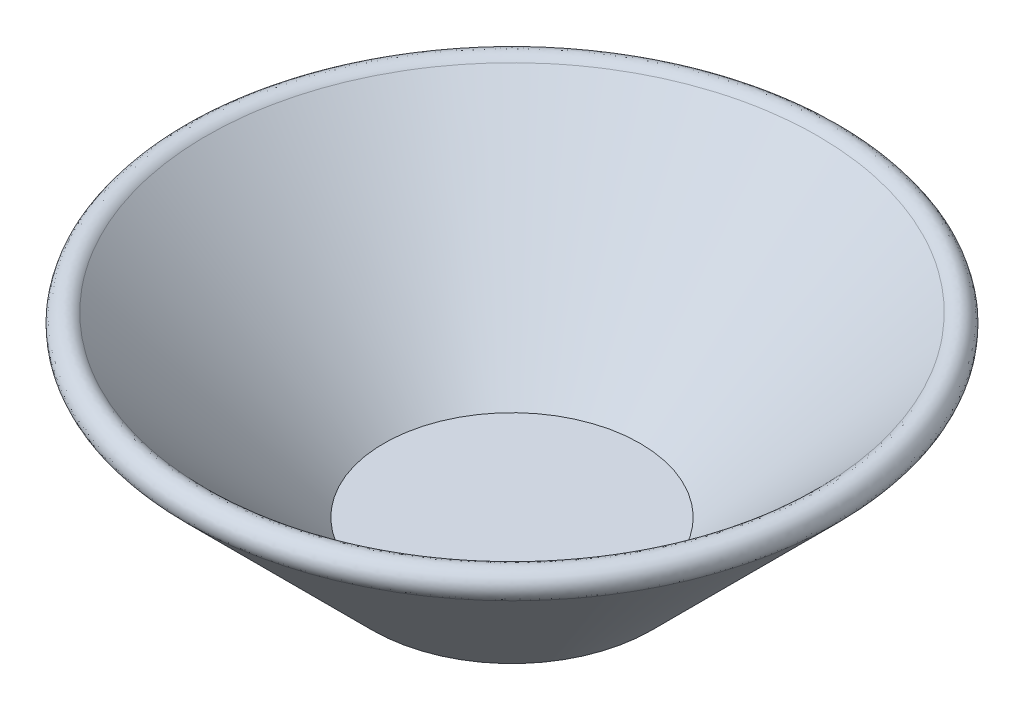
ISO-10303-21;
HEADER;
FILE_DESCRIPTION(('STEP AP214'),'2;1');
FILE_NAME('part.step','',(''),(''),'','','');
FILE_SCHEMA(('AUTOMOTIVE_DESIGN { 1 0 10303 214 1 1 1 1 }'));
ENDSEC;
DATA;
#1=APPLICATION_CONTEXT('core data for automotive mechanical design processes');
#2=APPLICATION_PROTOCOL_DEFINITION('international standard','automotive_design',2000,#1);
#3=PRODUCT_CONTEXT('',#1,'mechanical');
#4=PRODUCT('Part','Part','',(#3));
#5=PRODUCT_RELATED_PRODUCT_CATEGORY('part','',(#4));
#6=PRODUCT_DEFINITION_FORMATION('','',#4);
#7=PRODUCT_DEFINITION_CONTEXT('part definition',#1,'design');
#8=PRODUCT_DEFINITION('design','',#6,#7);
#9=PRODUCT_DEFINITION_SHAPE('','',#8);
#10=(LENGTH_UNIT() NAMED_UNIT(*) SI_UNIT(.MILLI.,.METRE.));
#11=(NAMED_UNIT(*) PLANE_ANGLE_UNIT() SI_UNIT($,.RADIAN.));
#12=(NAMED_UNIT(*) SI_UNIT($,.STERADIAN.) SOLID_ANGLE_UNIT());
#13=UNCERTAINTY_MEASURE_WITH_UNIT(LENGTH_MEASURE(1.E-05),#10,'distance_accuracy_value','');
#14=(GEOMETRIC_REPRESENTATION_CONTEXT(3) GLOBAL_UNCERTAINTY_ASSIGNED_CONTEXT((#13)) GLOBAL_UNIT_ASSIGNED_CONTEXT((#10,
#11,#12)) REPRESENTATION_CONTEXT('',''));
#15=CARTESIAN_POINT('',(0.,0.,0.));
#16=DIRECTION('',(0.,0.,1.));
#17=DIRECTION('',(1.,0.,0.));
#18=AXIS2_PLACEMENT_3D('',#15,#16,#17);
#19=CARTESIAN_POINT('',(-5.91341536482125E-13,7.35355339059327,-10.9393398282202));
#20=CARTESIAN_POINT('',(-1.42937261809624,7.35355339059331,-10.9393398282202));
#21=CARTESIAN_POINT('',(-2.86573600707871,7.35355339059477,-10.6536293861023));
#22=CARTESIAN_POINT('',(-5.50687221946527,7.35355339059177,-9.55963494685363));
#23=CARTESIAN_POINT('',(-6.72456230313676,7.35355339059349,-8.74600044534083));
#24=CARTESIAN_POINT('',(-8.74600044534125,7.35355339059306,-6.72456230313552));
#25=CARTESIAN_POINT('',(-9.55963494686001,7.35355339059446,-5.50687221945731));
#26=CARTESIAN_POINT('',(-10.6536293860968,7.35355339059209,-2.86573600708449));
#27=CARTESIAN_POINT('',(-10.9393398282202,7.35355339059324,-1.42937261809022));
#28=CARTESIAN_POINT('',(-10.9393398282202,7.35355339059331,1.4293726180914));
#29=CARTESIAN_POINT('',(-10.6536293861023,7.35355339059477,2.86573600707871));
#30=CARTESIAN_POINT('',(-9.55963494685363,7.35355339059177,5.50687221946527));
#31=CARTESIAN_POINT('',(-8.74600044533756,7.35355339059238,6.72456230313846));
#32=CARTESIAN_POINT('',(-6.72456230313878,7.35355339059417,8.74600044533955));
#33=CARTESIAN_POINT('',(-5.5068722194581,7.35355339059495,9.55963494686021));
#34=CARTESIAN_POINT('',(-2.86573600708369,7.3535533905916,10.6536293860966));
#35=CARTESIAN_POINT('',(-1.4293726180943,7.35355339059324,10.9393398282202));
#36=CARTESIAN_POINT('',(1.42937261809549,7.35355339059331,10.9393398282202));
#37=CARTESIAN_POINT('',(2.86573600708027,7.35355339059439,10.6536293861012));
#38=CARTESIAN_POINT('',(5.50687221946371,7.35355339059216,9.5596349468547));
#39=CARTESIAN_POINT('',(6.72456230314049,7.35355339059323,8.74600044533674));
#40=CARTESIAN_POINT('',(8.74600044533752,7.35355339059331,6.7245623031396));
#41=CARTESIAN_POINT('',(9.5596349468556,7.35355339059167,5.50687221946066));
#42=CARTESIAN_POINT('',(10.6536293861012,7.35355339059488,2.86573600708111));
#43=CARTESIAN_POINT('',(10.9393398282202,7.35355339059323,1.42937261809618));
#44=CARTESIAN_POINT('',(10.9393398282202,7.35355339059331,-1.42937261809737));
#45=CARTESIAN_POINT('',(10.6536293860994,7.35355339059183,-2.86573600707786));
#46=CARTESIAN_POINT('',(9.55963494685648,7.35355339059472,-5.5068722194661));
#47=CARTESIAN_POINT('',(8.74600044533816,7.35355339059323,-6.72456230313907));
#48=CARTESIAN_POINT('',(6.72456230313818,7.35355339059331,-8.74600044533894));
#49=CARTESIAN_POINT('',(5.50687221946095,7.35355339059347,-9.55963494685743));
#50=CARTESIAN_POINT('',(2.86573600708082,7.35355339059307,-10.6536293860994));
#51=CARTESIAN_POINT('',(1.42937261809505,7.35355339059324,-10.9393398282202));
#52=CARTESIAN_POINT('',(-5.91341536482125E-13,7.35355339059327,-10.9393398282202));
#53=CARTESIAN_POINT('',(-6.05229035295483E-13,7.58925565098879,-11.1750420886157));
#54=CARTESIAN_POINT('',(-1.46061614840998,7.58925565098879,-11.1750420886157));
#55=CARTESIAN_POINT('',(-2.92707009892641,7.58925565098808,-10.883346261667));
#56=CARTESIAN_POINT('',(-5.62593682766633,7.5892556509895,-9.76543905958105));
#57=CARTESIAN_POINT('',(-6.869136457655,7.58925565098808,-8.93475962415693));
#58=CARTESIAN_POINT('',(-8.93475962415636,7.5892556509895,-6.86913645765273));
#59=CARTESIAN_POINT('',(-9.76543905958719,7.58925565098808,-5.62593682766309));
#60=CARTESIAN_POINT('',(-10.8833462616618,7.5892556509895,-2.92707009892742));
#61=CARTESIAN_POINT('',(-11.1750420886157,7.5892556509895,-1.46061614840561));
#62=CARTESIAN_POINT('',(-11.1750420886157,7.58925565098808,1.46061614840682));
#63=CARTESIAN_POINT('',(-10.883346261667,7.58925565098879,2.9270700989257));
#64=CARTESIAN_POINT('',(-9.76543905958105,7.58925565098879,5.62593682766704));
#65=CARTESIAN_POINT('',(-8.93475962415551,7.5892556509895,6.86913645765358));
#66=CARTESIAN_POINT('',(-6.86913645765415,7.58925565098808,8.93475962415778));
#67=CARTESIAN_POINT('',(-5.62593682766238,7.58925565098808,9.76543905958719));
#68=CARTESIAN_POINT('',(-2.92707009892813,7.5892556509895,10.8833462616618));
#69=CARTESIAN_POINT('',(-1.46061614840697,7.5892556509895,11.1750420886157));
#70=CARTESIAN_POINT('',(1.46061614840818,7.58925565098808,11.1750420886157));
#71=CARTESIAN_POINT('',(2.92707009892569,7.58925565098808,10.883346261667));
#72=CARTESIAN_POINT('',(5.62593682766704,7.5892556509895,9.76543905958105));
#73=CARTESIAN_POINT('',(6.869136457655,7.58925565098879,8.93475962415551));
#74=CARTESIAN_POINT('',(8.93475962415636,7.58925565098879,6.86913645765415));
#75=CARTESIAN_POINT('',(9.76543905958293,7.5892556509895,5.62593682766308));
#76=CARTESIAN_POINT('',(10.883346261666,7.58925565098808,2.92707009892741));
#77=CARTESIAN_POINT('',(11.1750420886157,7.5892556509895,1.46061614840759));
#78=CARTESIAN_POINT('',(11.1750420886157,7.58925565098808,-1.46061614840881));
#79=CARTESIAN_POINT('',(10.8833462616641,7.58925565098808,-2.92707009892427));
#80=CARTESIAN_POINT('',(9.76543905958389,7.5892556509895,-5.62593682766845));
#81=CARTESIAN_POINT('',(8.93475962415692,7.5892556509895,-6.86913645765358));
#82=CARTESIAN_POINT('',(6.86913645765273,7.58925565098808,-8.93475962415778));
#83=CARTESIAN_POINT('',(5.6259368276645,7.58925565098879,-9.76543905958435));
#84=CARTESIAN_POINT('',(2.92707009892599,7.58925565098879,-10.8833462616646));
#85=CARTESIAN_POINT('',(1.46061614840877,7.58925565098879,-11.1750420886157));
#86=CARTESIAN_POINT('',(-6.05229035295483E-13,7.58925565098879,-11.1750420886157));
#87=CARTESIAN_POINT('',(-6.32144323908745E-13,7.70710678118655,-11.6464466094068));
#88=CARTESIAN_POINT('',(-1.52310320903637,7.70710678118655,-11.6464466094068));
#89=CARTESIAN_POINT('',(-3.04973828261836,7.70710678118512,-11.3427800127935));
#90=CARTESIAN_POINT('',(-5.86406604407189,7.70710678118796,-10.1770472850387));
#91=CARTESIAN_POINT('',(-7.15828476668834,7.70710678118584,-9.31227798179025));
#92=CARTESIAN_POINT('',(-9.31227798178972,7.70710678118725,-7.15828476668604));
#93=CARTESIAN_POINT('',(-10.1770472850392,7.70710678118442,-5.86406604407002));
#94=CARTESIAN_POINT('',(-11.342780012794,7.70710678118868,-3.0497382826179));
#95=CARTESIAN_POINT('',(-11.6464466094082,7.70710678118938,-1.52310320903397));
#96=CARTESIAN_POINT('',(-11.6464466094053,7.70710678118371,1.52310320903523));
#97=CARTESIAN_POINT('',(-11.3427800127949,7.70710678118584,3.04973828261836));
#98=CARTESIAN_POINT('',(-10.1770472850373,7.70710678118726,5.8640660440719));
#99=CARTESIAN_POINT('',(-9.31227798179167,7.70710678118868,7.15828476668551));
#100=CARTESIAN_POINT('',(-7.15828476668462,7.70710678118442,9.31227798179256));
#101=CARTESIAN_POINT('',(-5.86406604407002,7.70710678118371,10.1770472850378));
#102=CARTESIAN_POINT('',(-3.04973828261791,7.70710678118938,11.3427800127954));
#103=CARTESIAN_POINT('',(-1.52310320903166,7.70710678118938,11.6464466094082));
#104=CARTESIAN_POINT('',(1.52310320903293,7.70710678118371,11.6464466094053));
#105=CARTESIAN_POINT('',(3.04973828261694,7.70710678118442,11.3427800127963));
#106=CARTESIAN_POINT('',(5.86406604407331,7.70710678118868,10.1770472850359));
#107=CARTESIAN_POINT('',(7.15828476668409,7.70710678118655,9.31227798179025));
#108=CARTESIAN_POINT('',(9.31227798179398,7.70710678118655,7.15828476668604));
#109=CARTESIAN_POINT('',(10.1770472850392,7.70710678118938,5.8640660440693));
#110=CARTESIAN_POINT('',(11.342780012794,7.70710678118371,3.04973828261861));
#111=CARTESIAN_POINT('',(11.6464466094082,7.70710678118867,1.52310320903056));
#112=CARTESIAN_POINT('',(11.6464466094053,7.70710678118442,-1.52310320903182));
#113=CARTESIAN_POINT('',(11.3427800127949,7.70710678118654,-3.04973828261835));
#114=CARTESIAN_POINT('',(10.1770472850373,7.70710678118654,-5.86406604407188));
#115=CARTESIAN_POINT('',(9.31227798179734,7.70710678118867,-7.15828476668267));
#116=CARTESIAN_POINT('',(7.15828476667894,7.70710678118442,-9.3122779817954));
#117=CARTESIAN_POINT('',(5.86406604407072,7.70710678118797,-10.1770472850392));
#118=CARTESIAN_POINT('',(3.04973828261718,7.70710678118513,-11.342780012794));
#119=CARTESIAN_POINT('',(1.52310320903511,7.70710678118655,-11.6464466094068));
#120=CARTESIAN_POINT('',(-6.32144323908745E-13,7.70710678118655,-11.6464466094068));
#121=CARTESIAN_POINT('',(-6.51256154101875E-13,7.35355339059327,-12.));
#122=CARTESIAN_POINT('',(-1.56996850450479,7.35355339059327,-12.));
#123=CARTESIAN_POINT('',(-3.14173942038626,7.3535533905954,-11.687355326138));
#124=CARTESIAN_POINT('',(-6.04266295637712,7.35355339059114,-10.4857534541324));
#125=CARTESIAN_POINT('',(-7.3751459984637,7.35355339059185,-9.59541675001347));
#126=CARTESIAN_POINT('',(-9.59541675001438,7.35355339059469,-7.37514599846279));
#127=CARTESIAN_POINT('',(-10.48575345413,7.35355339059185,-6.04266295637451));
#128=CARTESIAN_POINT('',(-11.6873553261414,7.35355339059469,-3.14173942038648));
#129=CARTESIAN_POINT('',(-12.0000000000043,7.35355339059469,-1.5699685045022));
#130=CARTESIAN_POINT('',(-11.9999999999958,7.35355339059185,1.5699685045035));
#131=CARTESIAN_POINT('',(-11.6873553261423,7.3535533905954,3.14173942038697));
#132=CARTESIAN_POINT('',(-10.4857534541281,7.35355339059114,6.04266295637642));
#133=CARTESIAN_POINT('',(-9.5954167500234,7.35355339059185,7.37514599845945));
#134=CARTESIAN_POINT('',(-7.37514599845286,7.35355339059469,9.59541675001864));
#135=CARTESIAN_POINT('',(-6.04266295637309,7.35355339059256,10.4857534541244));
#136=CARTESIAN_POINT('',(-3.1417394203879,7.35355339059398,11.6873553261471));
#137=CARTESIAN_POINT('',(-1.56996850449936,7.35355339059469,12.0000000000043));
#138=CARTESIAN_POINT('',(1.56996850450066,7.35355339059185,11.9999999999958));
#139=CARTESIAN_POINT('',(3.14173942038484,7.35355339059327,11.6873553261409));
#140=CARTESIAN_POINT('',(6.04266295637854,7.35355339059327,10.4857534541296));
#141=CARTESIAN_POINT('',(7.37514599845803,7.35355339059398,9.59541675001915));
#142=CARTESIAN_POINT('',(9.59541675002007,7.35355339059256,7.37514599845712));
#143=CARTESIAN_POINT('',(10.4857534541329,7.35355339059398,6.04266295637308));
#144=CARTESIAN_POINT('',(11.6873553261385,7.35355339059256,3.14173942038789));
#145=CARTESIAN_POINT('',(12.0000000000014,7.35355339059469,1.56996850449792));
#146=CARTESIAN_POINT('',(11.9999999999986,7.35355339059185,-1.56996850449922));
#147=CARTESIAN_POINT('',(11.6873553261437,7.35355339059043,-3.14173942038767));
#148=CARTESIAN_POINT('',(10.4857534541267,7.3535533905961,-6.0426629563757));
#149=CARTESIAN_POINT('',(9.5954167500234,7.35355339059327,-7.37514599845945));
#150=CARTESIAN_POINT('',(7.37514599845286,7.35355339059327,-9.59541675001864));
#151=CARTESIAN_POINT('',(6.04266295637591,7.35355339059469,-10.4857534541286));
#152=CARTESIAN_POINT('',(3.14173942038505,7.35355339059185,-11.6873553261428));
#153=CARTESIAN_POINT('',(1.56996850450349,7.35355339059327,-12.));
#154=CARTESIAN_POINT('',(-6.51256154101875E-13,7.35355339059327,-12.));
#155=CARTESIAN_POINT('',(-6.43452695681744E-13,6.88214886980224,-11.8821488698023));
#156=CARTESIAN_POINT('',(-1.5543467393468,6.88214886980224,-11.8821488698023));
#157=CARTESIAN_POINT('',(-3.11107237446291,6.88214886980579,-11.5724968883603));
#158=CARTESIAN_POINT('',(-5.98313065227609,6.88214886979869,-10.3828513977641));
#159=CARTESIAN_POINT('',(-7.30285892120288,6.88214886980224,-9.5010371606062));
#160=CARTESIAN_POINT('',(-9.50103716060852,6.88214886980224,-7.3028589212034));
#161=CARTESIAN_POINT('',(-10.382851397766,6.88214886980224,-5.98313065227135));
#162=CARTESIAN_POINT('',(-11.5724968883594,6.88214886980224,-3.11107237446528));
#163=CARTESIAN_POINT('',(-11.8821488698023,6.88214886980153,-1.55434673934205));
#164=CARTESIAN_POINT('',(-11.8821488698023,6.88214886980295,1.55434673934333));
#165=CARTESIAN_POINT('',(-11.5724968883603,6.88214886980578,3.11107237446221));
#166=CARTESIAN_POINT('',(-10.3828513977641,6.88214886979869,5.9831306522768));
#167=CARTESIAN_POINT('',(-9.50103716061187,6.8821488697994,7.30285892119721));
#168=CARTESIAN_POINT('',(-7.30285892119772,6.88214886980508,9.50103716061421));
#169=CARTESIAN_POINT('',(-5.98313065227206,6.88214886980365,10.382851397766));
#170=CARTESIAN_POINT('',(-3.11107237446457,6.88214886980081,11.5724968883594));
#171=CARTESIAN_POINT('',(-1.55434673934234,6.88214886980153,11.8821488698023));
#172=CARTESIAN_POINT('',(1.55434673934364,6.88214886980295,11.8821488698023));
#173=CARTESIAN_POINT('',(3.11107237446433,6.88214886980366,11.5724968883603));
#174=CARTESIAN_POINT('',(5.98313065227467,6.88214886980082,10.3828513977641));
#175=CARTESIAN_POINT('',(7.30285892119863,6.88214886980365,9.50103716060904));
#176=CARTESIAN_POINT('',(9.50103716061278,6.88214886980081,7.30285892120056));
#177=CARTESIAN_POINT('',(10.382851397766,6.88214886980011,5.98313065227135));
#178=CARTESIAN_POINT('',(11.5724968883594,6.88214886980436,3.11107237446527));
#179=CARTESIAN_POINT('',(11.8821488698023,6.88214886980153,1.5543467393423));
#180=CARTESIAN_POINT('',(11.8821488698023,6.88214886980295,-1.55434673934359));
#181=CARTESIAN_POINT('',(11.5724968883575,6.88214886979869,-3.11107237446362));
#182=CARTESIAN_POINT('',(10.3828513977669,6.88214886980578,-5.98313065227537));
#183=CARTESIAN_POINT('',(9.50103716061188,6.88214886980011,-7.30285892119863));
#184=CARTESIAN_POINT('',(7.30285892119772,6.88214886980437,-9.50103716061278));
#185=CARTESIAN_POINT('',(5.98313065227418,6.88214886980152,-10.382851397766));
#186=CARTESIAN_POINT('',(3.11107237446243,6.88214886980294,-11.5724968883594));
#187=CARTESIAN_POINT('',(1.55434673934552,6.88214886980224,-11.8821488698023));
#188=CARTESIAN_POINT('',(-6.43452695681744E-13,6.88214886980224,-11.8821488698023));
#189=CARTESIAN_POINT('',(-6.29565196868386E-13,6.64644660940673,-11.6464466094067));
#190=CARTESIAN_POINT('',(-1.52310320903305,6.64644660940677,-11.6464466094067));
#191=CARTESIAN_POINT('',(-3.04973828261654,6.64644660940946,-11.3427800127985));
#192=CARTESIAN_POINT('',(-5.8640660440737,6.64644660940399,-10.1770472850337));
#193=CARTESIAN_POINT('',(-7.15828476668589,6.64644660940618,-9.31227798179063));
#194=CARTESIAN_POINT('',(-9.31227798179217,6.64644660940727,-7.15828476668566));
#195=CARTESIAN_POINT('',(-10.1770472850398,6.64644660940678,-5.86406604406672));
#196=CARTESIAN_POINT('',(-11.3427800127934,6.64644660940667,-3.0497382826212));
#197=CARTESIAN_POINT('',(-11.6464466094068,6.64644660940668,-1.52310320902665));
#198=CARTESIAN_POINT('',(-11.6464466094067,6.64644660940677,1.52310320902791));
#199=CARTESIAN_POINT('',(-11.3427800127985,6.64644660940946,3.04973828261654));
#200=CARTESIAN_POINT('',(-10.1770472850337,6.64644660940399,5.8640660440737));
#201=CARTESIAN_POINT('',(-9.31227798179368,6.64644660940447,7.15828476668042));
#202=CARTESIAN_POINT('',(-7.1582847666826,6.64644660940898,9.31227798179764));
#203=CARTESIAN_POINT('',(-5.86406604406792,6.64644660940806,10.1770472850407));
#204=CARTESIAN_POINT('',(-3.04973828262,6.64644660940538,11.3427800127925));
#205=CARTESIAN_POINT('',(-1.52310320902966,6.64644660940668,11.6464466094068));
#206=CARTESIAN_POINT('',(1.52310320903093,6.64644660940677,11.6464466094067));
#207=CARTESIAN_POINT('',(3.04973828261954,6.64644660940806,11.3427800127958));
#208=CARTESIAN_POINT('',(5.86406604407071,6.64644660940538,10.1770472850365));
#209=CARTESIAN_POINT('',(7.15828476668497,6.64644660940689,9.31227798179255));
#210=CARTESIAN_POINT('',(9.31227798179309,6.64644660940655,7.15828476668373));
#211=CARTESIAN_POINT('',(10.1770472850375,6.64644660940498,5.86406604406773));
#212=CARTESIAN_POINT('',(11.3427800127958,6.64644660940847,3.04973828262017));
#213=CARTESIAN_POINT('',(11.6464466094068,6.64644660940668,1.52310320903088));
#214=CARTESIAN_POINT('',(11.6464466094067,6.64644660940677,-1.52310320903214));
#215=CARTESIAN_POINT('',(11.342780012792,6.64644660940329,-3.04973828261618));
#216=CARTESIAN_POINT('',(10.1770472850403,6.64644660941016,-5.86406604407405));
#217=CARTESIAN_POINT('',(9.31227798179226,6.64644660940447,-7.15828476668184));
#218=CARTESIAN_POINT('',(7.15828476668402,6.64644660940898,-9.31227798179622));
#219=CARTESIAN_POINT('',(5.86406604407077,6.64644660940658,-10.1770472850379));
#220=CARTESIAN_POINT('',(3.04973828261713,6.64644660940686,-11.3427800127953));
#221=CARTESIAN_POINT('',(1.52310320903179,6.64644660940669,-11.6464466094068));
#222=CARTESIAN_POINT('',(-6.29565196868386E-13,6.64644660940673,-11.6464466094067));
#223=(BOUNDED_SURFACE() B_SPLINE_SURFACE(5,3,((#19,#20,#21,#22,#23,#24,#25,#26,#27,#28,#29,#30,
#31,#32,#33,#34,#35,#36,#37,#38,#39,#40,#41,#42,#43,#44,#45,#46,#47,#48,#49,#50,#51,#52),(#53,
#54,#55,#56,#57,#58,#59,#60,#61,#62,#63,#64,#65,#66,#67,#68,#69,#70,#71,#72,#73,#74,#75,#76,#77,
#78,#79,#80,#81,#82,#83,#84,#85,#86),(#87,#88,#89,#90,#91,#92,#93,#94,#95,#96,#97,#98,#99,#100,
#101,#102,#103,#104,#105,#106,#107,#108,#109,#110,#111,#112,#113,#114,#115,#116,#117,#118,#119,
#120),(#121,#122,#123,#124,#125,#126,#127,#128,#129,#130,#131,#132,#133,#134,#135,#136,#137,
#138,#139,#140,#141,#142,#143,#144,#145,#146,#147,#148,#149,#150,#151,#152,#153,#154),(#155,
#156,#157,#158,#159,#160,#161,#162,#163,#164,#165,#166,#167,#168,#169,#170,#171,#172,#173,#174,
#175,#176,#177,#178,#179,#180,#181,#182,#183,#184,#185,#186,#187,#188),(#189,#190,#191,#192,
#193,#194,#195,#196,#197,#198,#199,#200,#201,#202,#203,#204,#205,#206,#207,#208,#209,#210,#211,
#212,#213,#214,#215,#216,#217,#218,#219,#220,#221,#222)),.UNSPECIFIED.,.F.,.T.,
.F.) B_SPLINE_SURFACE_WITH_KNOTS((6,6),(4,2,2,2,2,2,2,2,2,2,2,2,2,2,2,2,4),(0.,1.),
(0.500000000000009,0.562500000000009,0.625000000000009,0.687500000000009,0.750000000000009,
0.812500000000009,0.875000000000009,0.937500000000009,1.00000000000001,1.06250000000001,
1.12500000000001,1.18750000000001,1.25000000000001,1.31250000000001,1.37500000000001,
1.43750000000001,1.50000000000001),
.UNSPECIFIED.) GEOMETRIC_REPRESENTATION_ITEM() RATIONAL_B_SPLINE_SURFACE(((1.,1.,1.,1.,1.,1.,1.,
1.,1.,1.,1.,1.,1.,1.,1.,1.,1.,1.,1.,1.,1.,1.,1.,1.,1.,1.,1.,1.,1.,1.,1.,1.,1.,1.),
(0.599999999999999,0.599999999999999,0.600000000000002,0.600000000000002,0.6,0.6,
0.599999999999998,0.599999999999998,0.599999999999999,0.599999999999999,0.599999999999998,
0.599999999999998,0.599999999999999,0.599999999999999,0.599999999999998,0.599999999999998,0.6,
0.6,0.599999999999999,0.599999999999999,0.599999999999997,0.599999999999997,0.599999999999999,
0.599999999999999,0.599999999999999,0.599999999999999,0.599999999999999,0.599999999999999,0.6,
0.6,0.599999999999998,0.599999999999998,0.599999999999999,0.599999999999999),(0.399999999999998,
0.399999999999998,0.400000000000003,0.400000000000003,0.4,0.4,0.399999999999997,
0.399999999999997,0.399999999999998,0.399999999999998,0.399999999999997,0.399999999999997,
0.399999999999998,0.399999999999998,0.399999999999997,0.399999999999997,0.4,0.4,
0.399999999999998,0.399999999999998,0.399999999999995,0.399999999999995,0.399999999999998,
0.399999999999998,0.399999999999999,0.399999999999999,0.399999999999999,0.399999999999999,0.4,
0.4,0.399999999999997,0.399999999999997,0.399999999999998,0.399999999999998),(0.399999999999998,
0.399999999999998,0.400000000000003,0.400000000000003,0.4,0.4,0.399999999999997,
0.399999999999997,0.399999999999998,0.399999999999998,0.399999999999997,0.399999999999997,
0.399999999999998,0.399999999999998,0.399999999999997,0.399999999999997,0.4,0.4,
0.399999999999998,0.399999999999998,0.399999999999995,0.399999999999995,0.399999999999998,
0.399999999999998,0.399999999999999,0.399999999999999,0.399999999999999,0.399999999999999,0.4,
0.4,0.399999999999997,0.399999999999997,0.399999999999998,0.399999999999998),(0.599999999999999,
0.599999999999999,0.600000000000002,0.600000000000002,0.6,0.6,0.599999999999998,
0.599999999999998,0.599999999999999,0.599999999999999,0.599999999999998,0.599999999999998,
0.599999999999999,0.599999999999999,0.599999999999998,0.599999999999998,0.6,0.6,
0.599999999999999,0.599999999999999,0.599999999999997,0.599999999999997,0.599999999999999,
0.599999999999999,0.599999999999999,0.599999999999999,0.599999999999999,0.599999999999999,0.6,
0.6,0.599999999999998,0.599999999999998,0.599999999999999,0.599999999999999),(1.,1.,1.,1.,1.,1.,
1.,1.,1.,1.,1.,1.,1.,1.,1.,1.,1.,1.,1.,1.,1.,1.,1.,1.,1.,1.,1.,1.,1.,1.,1.,1.,1.,1.))) REPRESENTATION_ITEM('') SURFACE());
#224=CARTESIAN_POINT('',(-6.29565196868386E-13,6.64644660940673,-11.6464466094067));
#225=CARTESIAN_POINT('',(-1.52310320903305,6.64644660940677,-11.6464466094067));
#226=CARTESIAN_POINT('',(-3.04973828261654,6.64644660940946,-11.3427800127985));
#227=CARTESIAN_POINT('',(-5.8640660440737,6.64644660940399,-10.1770472850337));
#228=CARTESIAN_POINT('',(-7.15828476668589,6.64644660940618,-9.31227798179063));
#229=CARTESIAN_POINT('',(-9.31227798179217,6.64644660940727,-7.15828476668566));
#230=CARTESIAN_POINT('',(-10.1770472850398,6.64644660940678,-5.86406604406672));
#231=CARTESIAN_POINT('',(-11.3427800127934,6.64644660940667,-3.0497382826212));
#232=CARTESIAN_POINT('',(-11.6464466094068,6.64644660940668,-1.52310320902665));
#233=CARTESIAN_POINT('',(-11.6464466094067,6.64644660940677,1.52310320902791));
#234=CARTESIAN_POINT('',(-11.3427800127985,6.64644660940946,3.04973828261654));
#235=CARTESIAN_POINT('',(-10.1770472850337,6.64644660940399,5.8640660440737));
#236=CARTESIAN_POINT('',(-9.31227798179368,6.64644660940447,7.15828476668042));
#237=CARTESIAN_POINT('',(-7.1582847666826,6.64644660940898,9.31227798179764));
#238=CARTESIAN_POINT('',(-5.86406604406792,6.64644660940806,10.1770472850407));
#239=CARTESIAN_POINT('',(-3.04973828262,6.64644660940538,11.3427800127925));
#240=CARTESIAN_POINT('',(-1.52310320902966,6.64644660940668,11.6464466094068));
#241=CARTESIAN_POINT('',(1.52310320903093,6.64644660940677,11.6464466094067));
#242=CARTESIAN_POINT('',(3.04973828261954,6.64644660940806,11.3427800127958));
#243=CARTESIAN_POINT('',(5.86406604407071,6.64644660940538,10.1770472850365));
#244=CARTESIAN_POINT('',(7.15828476668497,6.64644660940689,9.31227798179255));
#245=CARTESIAN_POINT('',(9.31227798179309,6.64644660940655,7.15828476668373));
#246=CARTESIAN_POINT('',(10.1770472850375,6.64644660940498,5.86406604406773));
#247=CARTESIAN_POINT('',(11.3427800127958,6.64644660940847,3.04973828262017));
#248=CARTESIAN_POINT('',(11.6464466094068,6.64644660940668,1.52310320903088));
#249=CARTESIAN_POINT('',(11.6464466094067,6.64644660940677,-1.52310320903214));
#250=CARTESIAN_POINT('',(11.342780012792,6.64644660940329,-3.04973828261618));
#251=CARTESIAN_POINT('',(10.1770472850403,6.64644660941016,-5.86406604407405));
#252=CARTESIAN_POINT('',(9.31227798179226,6.64644660940447,-7.15828476668184));
#253=CARTESIAN_POINT('',(7.15828476668402,6.64644660940898,-9.31227798179622));
#254=CARTESIAN_POINT('',(5.86406604407077,6.64644660940658,-10.1770472850379));
#255=CARTESIAN_POINT('',(3.04973828261713,6.64644660940686,-11.3427800127953));
#256=CARTESIAN_POINT('',(1.52310320903179,6.64644660940669,-11.6464466094068));
#257=CARTESIAN_POINT('',(-6.29565196868386E-13,6.64644660940673,-11.6464466094067));
#258=(BOUNDED_CURVE() B_SPLINE_CURVE(3,(#224,#225,#226,#227,#228,#229,#230,#231,#232,#233,#234,
#235,#236,#237,#238,#239,#240,#241,#242,#243,#244,#245,#246,#247,#248,#249,#250,#251,#252,#253,
#254,#255,#256,#257),.UNSPECIFIED.,.T.,.F.) B_SPLINE_CURVE_WITH_KNOTS((4,2,2,2,2,2,2,2,2,2,2,2,
2,2,2,2,4),(0.500000000000009,0.562500000000009,0.625000000000009,0.687500000000009,
0.750000000000009,0.812500000000009,0.875000000000009,0.937500000000009,1.00000000000001,
1.06250000000001,1.12500000000001,1.18750000000001,1.25000000000001,1.31250000000001,
1.37500000000001,1.43750000000001,1.50000000000001),
.UNSPECIFIED.) CURVE() GEOMETRIC_REPRESENTATION_ITEM() RATIONAL_B_SPLINE_CURVE((1.,1.,1.,1.,1.,
1.,1.,1.,1.,1.,1.,1.,1.,1.,1.,1.,1.,1.,1.,1.,1.,1.,1.,1.,1.,1.,1.,1.,1.,1.,1.,1.,1.,1.)) REPRESENTATION_ITEM(''));
#259=CARTESIAN_POINT('',(-6.29565196868386E-13,6.64644660940673,-11.6464466094067));
#260=VERTEX_POINT('',#259);
#261=EDGE_CURVE('E54',#260,#260,#258,.F.);
#262=CARTESIAN_POINT('',(-5.91341536482125E-13,7.35355339059327,-10.9393398282202));
#263=CARTESIAN_POINT('',(1.42937261809505,7.35355339059324,-10.9393398282202));
#264=CARTESIAN_POINT('',(2.86573600708082,7.35355339059307,-10.6536293860994));
#265=CARTESIAN_POINT('',(5.50687221946095,7.35355339059347,-9.55963494685743));
#266=CARTESIAN_POINT('',(6.72456230313818,7.35355339059331,-8.74600044533894));
#267=CARTESIAN_POINT('',(8.74600044533816,7.35355339059323,-6.72456230313907));
#268=CARTESIAN_POINT('',(9.55963494685648,7.35355339059472,-5.5068722194661));
#269=CARTESIAN_POINT('',(10.6536293860994,7.35355339059183,-2.86573600707786));
#270=CARTESIAN_POINT('',(10.9393398282202,7.35355339059331,-1.42937261809737));
#271=CARTESIAN_POINT('',(10.9393398282202,7.35355339059323,1.42937261809618));
#272=CARTESIAN_POINT('',(10.6536293861012,7.35355339059488,2.86573600708111));
#273=CARTESIAN_POINT('',(9.5596349468556,7.35355339059167,5.50687221946066));
#274=CARTESIAN_POINT('',(8.74600044533752,7.35355339059331,6.7245623031396));
#275=CARTESIAN_POINT('',(6.72456230314049,7.35355339059323,8.74600044533674));
#276=CARTESIAN_POINT('',(5.50687221946371,7.35355339059216,9.5596349468547));
#277=CARTESIAN_POINT('',(2.86573600708027,7.35355339059439,10.6536293861012));
#278=CARTESIAN_POINT('',(1.42937261809549,7.35355339059331,10.9393398282202));
#279=CARTESIAN_POINT('',(-1.4293726180943,7.35355339059324,10.9393398282202));
#280=CARTESIAN_POINT('',(-2.86573600708369,7.3535533905916,10.6536293860966));
#281=CARTESIAN_POINT('',(-5.5068722194581,7.35355339059495,9.55963494686021));
#282=CARTESIAN_POINT('',(-6.72456230313878,7.35355339059417,8.74600044533955));
#283=CARTESIAN_POINT('',(-8.74600044533756,7.35355339059238,6.72456230313846));
#284=CARTESIAN_POINT('',(-9.55963494685363,7.35355339059177,5.50687221946527));
#285=CARTESIAN_POINT('',(-10.6536293861023,7.35355339059477,2.86573600707871));
#286=CARTESIAN_POINT('',(-10.9393398282202,7.35355339059331,1.4293726180914));
#287=CARTESIAN_POINT('',(-10.9393398282202,7.35355339059324,-1.42937261809022));
#288=CARTESIAN_POINT('',(-10.6536293860968,7.35355339059209,-2.86573600708449));
#289=CARTESIAN_POINT('',(-9.55963494686001,7.35355339059446,-5.50687221945731));
#290=CARTESIAN_POINT('',(-8.74600044534125,7.35355339059306,-6.72456230313552));
#291=CARTESIAN_POINT('',(-6.72456230313676,7.35355339059349,-8.74600044534083));
#292=CARTESIAN_POINT('',(-5.50687221946527,7.35355339059177,-9.55963494685363));
#293=CARTESIAN_POINT('',(-2.86573600707871,7.35355339059477,-10.6536293861023));
#294=CARTESIAN_POINT('',(-1.42937261809624,7.35355339059331,-10.9393398282202));
#295=CARTESIAN_POINT('',(-5.91341536482125E-13,7.35355339059327,-10.9393398282202));
#296=(BOUNDED_CURVE() B_SPLINE_CURVE(3,(#262,#263,#264,#265,#266,#267,#268,#269,#270,#271,#272,
#273,#274,#275,#276,#277,#278,#279,#280,#281,#282,#283,#284,#285,#286,#287,#288,#289,#290,#291,
#292,#293,#294,#295),.UNSPECIFIED.,.T.,.F.) B_SPLINE_CURVE_WITH_KNOTS((4,2,2,2,2,2,2,2,2,2,2,2,
2,2,2,2,4),(0.500000000000009,0.562500000000009,0.625000000000009,0.687500000000009,
0.750000000000009,0.812500000000009,0.875000000000009,0.937500000000009,1.00000000000001,
1.06250000000001,1.12500000000001,1.18750000000001,1.25000000000001,1.31250000000001,
1.37500000000001,1.43750000000001,1.50000000000001),
.UNSPECIFIED.) CURVE() GEOMETRIC_REPRESENTATION_ITEM() RATIONAL_B_SPLINE_CURVE((1.,1.,1.,1.,1.,
1.,1.,1.,1.,1.,1.,1.,1.,1.,1.,1.,1.,1.,1.,1.,1.,1.,1.,1.,1.,1.,1.,1.,1.,1.,1.,1.,1.,1.)) REPRESENTATION_ITEM(''));
#297=CARTESIAN_POINT('',(-5.91341536482125E-13,7.35355339059327,-10.9393398282202));
#298=VERTEX_POINT('',#297);
#299=EDGE_CURVE('E10',#298,#298,#296,.F.);
#300=ORIENTED_EDGE('',*,*,#261,.F.);
#301=EDGE_LOOP('',(#300));
#302=FACE_BOUND('',#301,.T.);
#303=ORIENTED_EDGE('',*,*,#299,.F.);
#304=EDGE_LOOP('',(#303));
#305=FACE_BOUND('',#304,.T.);
#306=ADVANCED_FACE('F41',(#302,#305),#223,.T.);
#307=CARTESIAN_POINT('',(0.,0.,0.));
#308=DIRECTION('',(0.,1.,0.));
#309=DIRECTION('',(0.,0.,1.));
#310=AXIS2_PLACEMENT_3D('',#307,#308,#309);
#311=CONICAL_SURFACE('',#310,5.,0.78539816339745);
#312=ORIENTED_EDGE('',*,*,#261,.T.);
#313=EDGE_LOOP('',(#312));
#314=FACE_BOUND('',#313,.T.);
#315=CARTESIAN_POINT('',(0.,0.,0.));
#316=DIRECTION('',(0.,1.,0.));
#317=DIRECTION('',(0.,0.,1.));
#318=AXIS2_PLACEMENT_3D('',#315,#316,#317);
#319=CIRCLE('',#318,5.);
#320=CARTESIAN_POINT('',(0.,0.,5.));
#321=VERTEX_POINT('',#320);
#322=EDGE_CURVE('E60',#321,#321,#319,.T.);
#323=ORIENTED_EDGE('',*,*,#322,.T.);
#324=EDGE_LOOP('',(#323));
#325=FACE_BOUND('',#324,.T.);
#326=ADVANCED_FACE('F77',(#314,#325),#311,.T.);
#327=CARTESIAN_POINT('',(0.,0.,0.));
#328=DIRECTION('',(0.,1.,0.));
#329=DIRECTION('',(0.,0.,1.));
#330=AXIS2_PLACEMENT_3D('',#327,#328,#329);
#331=PLANE('',#330);
#332=ORIENTED_EDGE('',*,*,#322,.F.);
#333=EDGE_LOOP('',(#332));
#334=FACE_BOUND('',#333,.T.);
#335=ADVANCED_FACE('F86',(#334),#331,.F.);
#336=CARTESIAN_POINT('',(0.,0.707106781186549,0.));
#337=DIRECTION('',(0.,1.,0.));
#338=DIRECTION('',(0.,0.,1.));
#339=AXIS2_PLACEMENT_3D('',#336,#337,#338);
#340=CONICAL_SURFACE('',#339,4.29289321881345,0.78539816339745);
#341=ORIENTED_EDGE('',*,*,#299,.T.);
#342=EDGE_LOOP('',(#341));
#343=FACE_BOUND('',#342,.T.);
#344=CARTESIAN_POINT('',(0.,1.,0.));
#345=DIRECTION('',(0.,1.,0.));
#346=DIRECTION('',(0.,0.,1.));
#347=AXIS2_PLACEMENT_3D('',#344,#345,#346);
#348=CIRCLE('',#347,4.58578643762691);
#349=CARTESIAN_POINT('',(0.,1.,4.58578643762691));
#350=VERTEX_POINT('',#349);
#351=EDGE_CURVE('E66',#350,#350,#348,.T.);
#352=ORIENTED_EDGE('',*,*,#351,.F.);
#353=EDGE_LOOP('',(#352));
#354=FACE_BOUND('',#353,.T.);
#355=ADVANCED_FACE('F89',(#343,#354),#340,.F.);
#356=CARTESIAN_POINT('',(0.,1.,0.));
#357=DIRECTION('',(0.,1.,0.));
#358=DIRECTION('',(0.,0.,1.));
#359=AXIS2_PLACEMENT_3D('',#356,#357,#358);
#360=PLANE('',#359);
#361=ORIENTED_EDGE('',*,*,#351,.T.);
#362=EDGE_LOOP('',(#361));
#363=FACE_BOUND('',#362,.T.);
#364=ADVANCED_FACE('F91',(#363),#360,.T.);
#365=CLOSED_SHELL('',(#306,#326,#335,#355,#364));
#366=MANIFOLD_SOLID_BREP('B2',#365);
#367=ADVANCED_BREP_SHAPE_REPRESENTATION('',(#18,#366),#14);
#368=SHAPE_DEFINITION_REPRESENTATION(#9,#367);
ENDSEC;
END-ISO-10303-21;
